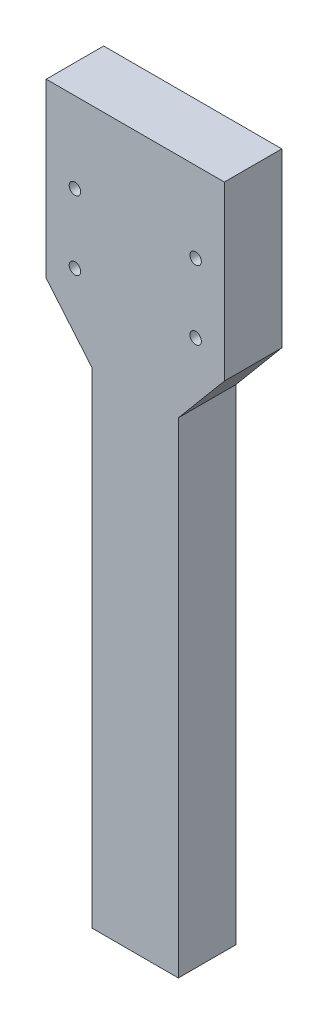
ISO-10303-21;
HEADER;
FILE_DESCRIPTION(('STEP AP214'),'2;1');
FILE_NAME('part.step','',(''),(''),'','','');
FILE_SCHEMA(('AUTOMOTIVE_DESIGN { 1 0 10303 214 1 1 1 1 }'));
ENDSEC;
DATA;
#1=APPLICATION_CONTEXT('core data for automotive mechanical design processes');
#2=APPLICATION_PROTOCOL_DEFINITION('international standard','automotive_design',2000,#1);
#3=PRODUCT_CONTEXT('',#1,'mechanical');
#4=PRODUCT('Part','Part','',(#3));
#5=PRODUCT_RELATED_PRODUCT_CATEGORY('part','',(#4));
#6=PRODUCT_DEFINITION_FORMATION('','',#4);
#7=PRODUCT_DEFINITION_CONTEXT('part definition',#1,'design');
#8=PRODUCT_DEFINITION('design','',#6,#7);
#9=PRODUCT_DEFINITION_SHAPE('','',#8);
#10=(LENGTH_UNIT() NAMED_UNIT(*) SI_UNIT(.MILLI.,.METRE.));
#11=(NAMED_UNIT(*) PLANE_ANGLE_UNIT() SI_UNIT($,.RADIAN.));
#12=(NAMED_UNIT(*) SI_UNIT($,.STERADIAN.) SOLID_ANGLE_UNIT());
#13=UNCERTAINTY_MEASURE_WITH_UNIT(LENGTH_MEASURE(1.E-05),#10,'distance_accuracy_value','');
#14=(GEOMETRIC_REPRESENTATION_CONTEXT(3) GLOBAL_UNCERTAINTY_ASSIGNED_CONTEXT((#13)) GLOBAL_UNIT_ASSIGNED_CONTEXT((#10,
#11,#12)) REPRESENTATION_CONTEXT('',''));
#15=CARTESIAN_POINT('',(0.,0.,0.));
#16=DIRECTION('',(0.,0.,1.));
#17=DIRECTION('',(1.,0.,0.));
#18=AXIS2_PLACEMENT_3D('',#15,#16,#17);
#19=CARTESIAN_POINT('',(0.,0.,10.));
#20=DIRECTION('',(0.,0.,-1.));
#21=DIRECTION('',(-1.,0.,0.));
#22=AXIS2_PLACEMENT_3D('',#19,#20,#21);
#23=PLANE('',#22);
#24=DIRECTION('',(0.,-1.,0.));
#25=VECTOR('',#24,1.);
#26=CARTESIAN_POINT('',(0.,0.,10.));
#27=LINE('',#26,#25);
#28=CARTESIAN_POINT('',(0.,84.4259712592463,10.));
#29=VERTEX_POINT('',#28);
#30=CARTESIAN_POINT('',(0.,0.,10.));
#31=VERTEX_POINT('',#30);
#32=EDGE_CURVE('E144',#29,#31,#27,.T.);
#33=ORIENTED_EDGE('',*,*,#32,.T.);
#34=DIRECTION('',(1.,0.,0.));
#35=VECTOR('',#34,1.);
#36=CARTESIAN_POINT('',(0.,0.,10.));
#37=LINE('',#36,#35);
#38=CARTESIAN_POINT('',(15.,0.,10.));
#39=VERTEX_POINT('',#38);
#40=EDGE_CURVE('E92',#31,#39,#37,.T.);
#41=ORIENTED_EDGE('',*,*,#40,.T.);
#42=DIRECTION('',(0.,1.,0.));
#43=VECTOR('',#42,1.);
#44=CARTESIAN_POINT('',(15.,0.,10.));
#45=LINE('',#44,#43);
#46=CARTESIAN_POINT('',(15.,84.4259712592463,10.));
#47=VERTEX_POINT('',#46);
#48=EDGE_CURVE('E159',#39,#47,#45,.T.);
#49=ORIENTED_EDGE('',*,*,#48,.T.);
#50=DIRECTION('',(0.64278760968654,0.766044443118978,0.));
#51=VECTOR('',#50,1.);
#52=CARTESIAN_POINT('',(15.,84.4259712592463,10.));
#53=LINE('',#52,#51);
#54=CARTESIAN_POINT('',(23.,93.96,10.));
#55=VERTEX_POINT('',#54);
#56=EDGE_CURVE('E172',#47,#55,#53,.T.);
#57=ORIENTED_EDGE('',*,*,#56,.T.);
#58=DIRECTION('',(0.,1.,0.));
#59=VECTOR('',#58,1.);
#60=CARTESIAN_POINT('',(23.,93.96,10.));
#61=LINE('',#60,#59);
#62=CARTESIAN_POINT('',(23.,123.96,10.));
#63=VERTEX_POINT('',#62);
#64=EDGE_CURVE('E111',#55,#63,#61,.T.);
#65=ORIENTED_EDGE('',*,*,#64,.T.);
#66=DIRECTION('',(-1.,0.,0.));
#67=VECTOR('',#66,1.);
#68=CARTESIAN_POINT('',(23.,123.96,10.));
#69=LINE('',#68,#67);
#70=CARTESIAN_POINT('',(-8.,123.96,10.));
#71=VERTEX_POINT('',#70);
#72=EDGE_CURVE('E105',#63,#71,#69,.T.);
#73=ORIENTED_EDGE('',*,*,#72,.T.);
#74=DIRECTION('',(0.,-1.,0.));
#75=VECTOR('',#74,1.);
#76=CARTESIAN_POINT('',(-7.99999999999999,93.96,10.));
#77=LINE('',#76,#75);
#78=CARTESIAN_POINT('',(-7.99999999999999,93.96,10.));
#79=VERTEX_POINT('',#78);
#80=EDGE_CURVE('E109',#71,#79,#77,.T.);
#81=ORIENTED_EDGE('',*,*,#80,.T.);
#82=DIRECTION('',(0.64278760968654,-0.766044443118977,0.));
#83=VECTOR('',#82,1.);
#84=CARTESIAN_POINT('',(0.,84.4259712592463,10.));
#85=LINE('',#84,#83);
#86=EDGE_CURVE('E49',#79,#29,#85,.T.);
#87=ORIENTED_EDGE('',*,*,#86,.T.);
#88=EDGE_LOOP('',(#33,#41,#49,#57,#65,#73,#81,#87));
#89=FACE_BOUND('',#88,.T.);
#90=CARTESIAN_POINT('',(-3.,109.96,10.));
#91=DIRECTION('',(0.,0.,1.));
#92=DIRECTION('',(1.,0.,0.));
#93=AXIS2_PLACEMENT_3D('',#90,#91,#92);
#94=CIRCLE('',#93,1.);
#95=CARTESIAN_POINT('',(-2.,109.96,10.));
#96=VERTEX_POINT('',#95);
#97=EDGE_CURVE('E132',#96,#96,#94,.T.);
#98=ORIENTED_EDGE('',*,*,#97,.F.);
#99=EDGE_LOOP('',(#98));
#100=FACE_BOUND('',#99,.T.);
#101=CARTESIAN_POINT('',(-3.,97.96,10.));
#102=DIRECTION('',(0.,0.,1.));
#103=DIRECTION('',(1.,0.,0.));
#104=AXIS2_PLACEMENT_3D('',#101,#102,#103);
#105=CIRCLE('',#104,1.);
#106=CARTESIAN_POINT('',(-2.,97.96,10.));
#107=VERTEX_POINT('',#106);
#108=EDGE_CURVE('E181',#107,#107,#105,.T.);
#109=ORIENTED_EDGE('',*,*,#108,.F.);
#110=EDGE_LOOP('',(#109));
#111=FACE_BOUND('',#110,.T.);
#112=CARTESIAN_POINT('',(18.,97.96,10.));
#113=DIRECTION('',(0.,0.,1.));
#114=DIRECTION('',(-1.,0.,0.));
#115=AXIS2_PLACEMENT_3D('',#112,#113,#114);
#116=CIRCLE('',#115,1.);
#117=CARTESIAN_POINT('',(17.,97.96,10.));
#118=VERTEX_POINT('',#117);
#119=EDGE_CURVE('E187',#118,#118,#116,.T.);
#120=ORIENTED_EDGE('',*,*,#119,.F.);
#121=EDGE_LOOP('',(#120));
#122=FACE_BOUND('',#121,.T.);
#123=CARTESIAN_POINT('',(18.,109.96,10.));
#124=DIRECTION('',(0.,0.,1.));
#125=DIRECTION('',(-1.,0.,0.));
#126=AXIS2_PLACEMENT_3D('',#123,#124,#125);
#127=CIRCLE('',#126,1.);
#128=CARTESIAN_POINT('',(17.,109.96,10.));
#129=VERTEX_POINT('',#128);
#130=EDGE_CURVE('E193',#129,#129,#127,.T.);
#131=ORIENTED_EDGE('',*,*,#130,.F.);
#132=EDGE_LOOP('',(#131));
#133=FACE_BOUND('',#132,.T.);
#134=ADVANCED_FACE('F32',(#89,#100,#111,#122,#133),#23,.F.);
#135=CARTESIAN_POINT('',(0.,0.,0.));
#136=DIRECTION('',(0.,0.,-1.));
#137=DIRECTION('',(-1.,0.,0.));
#138=AXIS2_PLACEMENT_3D('',#135,#136,#137);
#139=PLANE('',#138);
#140=CARTESIAN_POINT('',(18.,97.96,0.));
#141=DIRECTION('',(0.,0.,1.));
#142=DIRECTION('',(-1.,0.,0.));
#143=AXIS2_PLACEMENT_3D('',#140,#141,#142);
#144=CIRCLE('',#143,1.);
#145=CARTESIAN_POINT('',(17.,97.96,0.));
#146=VERTEX_POINT('',#145);
#147=EDGE_CURVE('E190',#146,#146,#144,.T.);
#148=ORIENTED_EDGE('',*,*,#147,.T.);
#149=EDGE_LOOP('',(#148));
#150=FACE_BOUND('',#149,.T.);
#151=CARTESIAN_POINT('',(-3.,109.96,0.));
#152=DIRECTION('',(0.,0.,1.));
#153=DIRECTION('',(1.,0.,0.));
#154=AXIS2_PLACEMENT_3D('',#151,#152,#153);
#155=CIRCLE('',#154,1.);
#156=CARTESIAN_POINT('',(-2.,109.96,0.));
#157=VERTEX_POINT('',#156);
#158=EDGE_CURVE('E178',#157,#157,#155,.T.);
#159=ORIENTED_EDGE('',*,*,#158,.T.);
#160=EDGE_LOOP('',(#159));
#161=FACE_BOUND('',#160,.T.);
#162=DIRECTION('',(0.,-1.,0.));
#163=VECTOR('',#162,1.);
#164=CARTESIAN_POINT('',(0.,0.,0.));
#165=LINE('',#164,#163);
#166=CARTESIAN_POINT('',(0.,84.4259712592463,0.));
#167=VERTEX_POINT('',#166);
#168=CARTESIAN_POINT('',(0.,0.,0.));
#169=VERTEX_POINT('',#168);
#170=EDGE_CURVE('E128',#167,#169,#165,.T.);
#171=ORIENTED_EDGE('',*,*,#170,.F.);
#172=DIRECTION('',(0.64278760968654,-0.766044443118977,0.));
#173=VECTOR('',#172,1.);
#174=CARTESIAN_POINT('',(0.,84.4259712592463,0.));
#175=LINE('',#174,#173);
#176=CARTESIAN_POINT('',(-7.99999999999999,93.96,0.));
#177=VERTEX_POINT('',#176);
#178=EDGE_CURVE('E84',#177,#167,#175,.T.);
#179=ORIENTED_EDGE('',*,*,#178,.F.);
#180=DIRECTION('',(0.,-1.,0.));
#181=VECTOR('',#180,1.);
#182=CARTESIAN_POINT('',(-7.99999999999999,93.96,0.));
#183=LINE('',#182,#181);
#184=CARTESIAN_POINT('',(-8.,123.96,0.));
#185=VERTEX_POINT('',#184);
#186=EDGE_CURVE('E78',#185,#177,#183,.T.);
#187=ORIENTED_EDGE('',*,*,#186,.F.);
#188=DIRECTION('',(-1.,0.,0.));
#189=VECTOR('',#188,1.);
#190=CARTESIAN_POINT('',(-8.,123.96,0.));
#191=LINE('',#190,#189);
#192=CARTESIAN_POINT('',(23.,123.96,0.));
#193=VERTEX_POINT('',#192);
#194=EDGE_CURVE('E118',#193,#185,#191,.T.);
#195=ORIENTED_EDGE('',*,*,#194,.F.);
#196=DIRECTION('',(0.,1.,0.));
#197=VECTOR('',#196,1.);
#198=CARTESIAN_POINT('',(23.,93.96,0.));
#199=LINE('',#198,#197);
#200=CARTESIAN_POINT('',(23.,93.96,0.));
#201=VERTEX_POINT('',#200);
#202=EDGE_CURVE('E138',#201,#193,#199,.T.);
#203=ORIENTED_EDGE('',*,*,#202,.F.);
#204=DIRECTION('',(0.64278760968654,0.766044443118978,0.));
#205=VECTOR('',#204,1.);
#206=CARTESIAN_POINT('',(15.,84.4259712592463,0.));
#207=LINE('',#206,#205);
#208=CARTESIAN_POINT('',(15.,84.4259712592463,0.));
#209=VERTEX_POINT('',#208);
#210=EDGE_CURVE('E136',#209,#201,#207,.T.);
#211=ORIENTED_EDGE('',*,*,#210,.F.);
#212=DIRECTION('',(0.,1.,0.));
#213=VECTOR('',#212,1.);
#214=CARTESIAN_POINT('',(15.,0.,0.));
#215=LINE('',#214,#213);
#216=CARTESIAN_POINT('',(15.,0.,0.));
#217=VERTEX_POINT('',#216);
#218=EDGE_CURVE('E134',#217,#209,#215,.T.);
#219=ORIENTED_EDGE('',*,*,#218,.F.);
#220=DIRECTION('',(1.,0.,0.));
#221=VECTOR('',#220,1.);
#222=CARTESIAN_POINT('',(0.,0.,0.));
#223=LINE('',#222,#221);
#224=EDGE_CURVE('E131',#169,#217,#223,.T.);
#225=ORIENTED_EDGE('',*,*,#224,.F.);
#226=EDGE_LOOP('',(#171,#179,#187,#195,#203,#211,#219,#225));
#227=FACE_BOUND('',#226,.T.);
#228=CARTESIAN_POINT('',(-3.,97.96,0.));
#229=DIRECTION('',(0.,0.,1.));
#230=DIRECTION('',(1.,0.,0.));
#231=AXIS2_PLACEMENT_3D('',#228,#229,#230);
#232=CIRCLE('',#231,1.);
#233=CARTESIAN_POINT('',(-2.,97.96,0.));
#234=VERTEX_POINT('',#233);
#235=EDGE_CURVE('E184',#234,#234,#232,.T.);
#236=ORIENTED_EDGE('',*,*,#235,.T.);
#237=EDGE_LOOP('',(#236));
#238=FACE_BOUND('',#237,.T.);
#239=CARTESIAN_POINT('',(18.,109.96,0.));
#240=DIRECTION('',(0.,0.,1.));
#241=DIRECTION('',(-1.,0.,0.));
#242=AXIS2_PLACEMENT_3D('',#239,#240,#241);
#243=CIRCLE('',#242,1.);
#244=CARTESIAN_POINT('',(17.,109.96,0.));
#245=VERTEX_POINT('',#244);
#246=EDGE_CURVE('E196',#245,#245,#243,.T.);
#247=ORIENTED_EDGE('',*,*,#246,.T.);
#248=EDGE_LOOP('',(#247));
#249=FACE_BOUND('',#248,.T.);
#250=ADVANCED_FACE('F163',(#150,#161,#227,#238,#249),#139,.T.);
#251=CARTESIAN_POINT('',(0.,0.,10.));
#252=DIRECTION('',(1.,0.,0.));
#253=DIRECTION('',(0.,0.,-1.));
#254=AXIS2_PLACEMENT_3D('',#251,#252,#253);
#255=PLANE('',#254);
#256=ORIENTED_EDGE('',*,*,#170,.T.);
#257=DIRECTION('',(0.,0.,-1.));
#258=VECTOR('',#257,1.);
#259=CARTESIAN_POINT('',(0.,0.,10.));
#260=LINE('',#259,#258);
#261=EDGE_CURVE('E11',#31,#169,#260,.T.);
#262=ORIENTED_EDGE('',*,*,#261,.F.);
#263=ORIENTED_EDGE('',*,*,#32,.F.);
#264=DIRECTION('',(0.,0.,-1.));
#265=VECTOR('',#264,1.);
#266=CARTESIAN_POINT('',(0.,84.4259712592463,10.));
#267=LINE('',#266,#265);
#268=EDGE_CURVE('E124',#29,#167,#267,.T.);
#269=ORIENTED_EDGE('',*,*,#268,.T.);
#270=EDGE_LOOP('',(#256,#262,#263,#269));
#271=FACE_BOUND('',#270,.T.);
#272=ADVANCED_FACE('F34',(#271),#255,.F.);
#273=CARTESIAN_POINT('',(0.,0.,10.));
#274=DIRECTION('',(0.,1.,0.));
#275=DIRECTION('',(0.,0.,1.));
#276=AXIS2_PLACEMENT_3D('',#273,#274,#275);
#277=PLANE('',#276);
#278=ORIENTED_EDGE('',*,*,#224,.T.);
#279=DIRECTION('',(0.,0.,-1.));
#280=VECTOR('',#279,1.);
#281=CARTESIAN_POINT('',(15.,0.,10.));
#282=LINE('',#281,#280);
#283=EDGE_CURVE('E41',#39,#217,#282,.T.);
#284=ORIENTED_EDGE('',*,*,#283,.F.);
#285=ORIENTED_EDGE('',*,*,#40,.F.);
#286=ORIENTED_EDGE('',*,*,#261,.T.);
#287=EDGE_LOOP('',(#278,#284,#285,#286));
#288=FACE_BOUND('',#287,.T.);
#289=ADVANCED_FACE('F228',(#288),#277,.F.);
#290=CARTESIAN_POINT('',(15.,0.,10.));
#291=DIRECTION('',(-1.,0.,0.));
#292=DIRECTION('',(0.,-1.,0.));
#293=AXIS2_PLACEMENT_3D('',#290,#291,#292);
#294=PLANE('',#293);
#295=ORIENTED_EDGE('',*,*,#218,.T.);
#296=DIRECTION('',(0.,0.,-1.));
#297=VECTOR('',#296,1.);
#298=CARTESIAN_POINT('',(15.,84.4259712592463,10.));
#299=LINE('',#298,#297);
#300=EDGE_CURVE('E151',#47,#209,#299,.T.);
#301=ORIENTED_EDGE('',*,*,#300,.F.);
#302=ORIENTED_EDGE('',*,*,#48,.F.);
#303=ORIENTED_EDGE('',*,*,#283,.T.);
#304=EDGE_LOOP('',(#295,#301,#302,#303));
#305=FACE_BOUND('',#304,.T.);
#306=ADVANCED_FACE('F157',(#305),#294,.F.);
#307=CARTESIAN_POINT('',(15.,84.4259712592463,10.));
#308=DIRECTION('',(-0.766044443118978,0.64278760968654,0.));
#309=DIRECTION('',(-0.64278760968654,-0.766044443118978,0.));
#310=AXIS2_PLACEMENT_3D('',#307,#308,#309);
#311=PLANE('',#310);
#312=ORIENTED_EDGE('',*,*,#210,.T.);
#313=DIRECTION('',(0.,0.,-1.));
#314=VECTOR('',#313,1.);
#315=CARTESIAN_POINT('',(23.,93.96,10.));
#316=LINE('',#315,#314);
#317=EDGE_CURVE('E148',#55,#201,#316,.T.);
#318=ORIENTED_EDGE('',*,*,#317,.F.);
#319=ORIENTED_EDGE('',*,*,#56,.F.);
#320=ORIENTED_EDGE('',*,*,#300,.T.);
#321=EDGE_LOOP('',(#312,#318,#319,#320));
#322=FACE_BOUND('',#321,.T.);
#323=ADVANCED_FACE('F168',(#322),#311,.F.);
#324=CARTESIAN_POINT('',(23.,93.96,10.));
#325=DIRECTION('',(-1.,0.,0.));
#326=DIRECTION('',(0.,0.,1.));
#327=AXIS2_PLACEMENT_3D('',#324,#325,#326);
#328=PLANE('',#327);
#329=ORIENTED_EDGE('',*,*,#202,.T.);
#330=DIRECTION('',(0.,0.,-1.));
#331=VECTOR('',#330,1.);
#332=CARTESIAN_POINT('',(23.,123.96,10.));
#333=LINE('',#332,#331);
#334=EDGE_CURVE('E119',#63,#193,#333,.T.);
#335=ORIENTED_EDGE('',*,*,#334,.F.);
#336=ORIENTED_EDGE('',*,*,#64,.F.);
#337=ORIENTED_EDGE('',*,*,#317,.T.);
#338=EDGE_LOOP('',(#329,#335,#336,#337));
#339=FACE_BOUND('',#338,.T.);
#340=ADVANCED_FACE('F171',(#339),#328,.F.);
#341=CARTESIAN_POINT('',(-8.,123.96,10.));
#342=DIRECTION('',(0.,-1.,0.));
#343=DIRECTION('',(0.,0.,-1.));
#344=AXIS2_PLACEMENT_3D('',#341,#342,#343);
#345=PLANE('',#344);
#346=ORIENTED_EDGE('',*,*,#194,.T.);
#347=DIRECTION('',(0.,0.,-1.));
#348=VECTOR('',#347,1.);
#349=CARTESIAN_POINT('',(-8.,123.96,10.));
#350=LINE('',#349,#348);
#351=EDGE_CURVE('E116',#71,#185,#350,.T.);
#352=ORIENTED_EDGE('',*,*,#351,.F.);
#353=ORIENTED_EDGE('',*,*,#72,.F.);
#354=ORIENTED_EDGE('',*,*,#334,.T.);
#355=EDGE_LOOP('',(#346,#352,#353,#354));
#356=FACE_BOUND('',#355,.T.);
#357=ADVANCED_FACE('F117',(#356),#345,.F.);
#358=CARTESIAN_POINT('',(-7.99999999999999,93.96,10.));
#359=DIRECTION('',(1.,0.,0.));
#360=DIRECTION('',(0.,1.,0.));
#361=AXIS2_PLACEMENT_3D('',#358,#359,#360);
#362=PLANE('',#361);
#363=ORIENTED_EDGE('',*,*,#186,.T.);
#364=DIRECTION('',(0.,0.,-1.));
#365=VECTOR('',#364,1.);
#366=CARTESIAN_POINT('',(-7.99999999999999,93.96,10.));
#367=LINE('',#366,#365);
#368=EDGE_CURVE('E120',#79,#177,#367,.T.);
#369=ORIENTED_EDGE('',*,*,#368,.F.);
#370=ORIENTED_EDGE('',*,*,#80,.F.);
#371=ORIENTED_EDGE('',*,*,#351,.T.);
#372=EDGE_LOOP('',(#363,#369,#370,#371));
#373=FACE_BOUND('',#372,.T.);
#374=ADVANCED_FACE('F122',(#373),#362,.F.);
#375=CARTESIAN_POINT('',(0.,84.4259712592463,10.));
#376=DIRECTION('',(0.766044443118977,0.64278760968654,0.));
#377=DIRECTION('',(-0.64278760968654,0.766044443118978,0.));
#378=AXIS2_PLACEMENT_3D('',#375,#376,#377);
#379=PLANE('',#378);
#380=ORIENTED_EDGE('',*,*,#178,.T.);
#381=ORIENTED_EDGE('',*,*,#268,.F.);
#382=ORIENTED_EDGE('',*,*,#86,.F.);
#383=ORIENTED_EDGE('',*,*,#368,.T.);
#384=EDGE_LOOP('',(#380,#381,#382,#383));
#385=FACE_BOUND('',#384,.T.);
#386=ADVANCED_FACE('F216',(#385),#379,.F.);
#387=CARTESIAN_POINT('',(-3.,109.96,10.));
#388=DIRECTION('',(0.,0.,-1.));
#389=DIRECTION('',(-1.,0.,0.));
#390=AXIS2_PLACEMENT_3D('',#387,#388,#389);
#391=CYLINDRICAL_SURFACE('',#390,1.);
#392=ORIENTED_EDGE('',*,*,#97,.T.);
#393=EDGE_LOOP('',(#392));
#394=FACE_BOUND('',#393,.T.);
#395=ORIENTED_EDGE('',*,*,#158,.F.);
#396=EDGE_LOOP('',(#395));
#397=FACE_BOUND('',#396,.T.);
#398=ADVANCED_FACE('F213',(#394,#397),#391,.F.);
#399=CARTESIAN_POINT('',(-3.,97.96,10.));
#400=DIRECTION('',(0.,0.,-1.));
#401=DIRECTION('',(-1.,0.,0.));
#402=AXIS2_PLACEMENT_3D('',#399,#400,#401);
#403=CYLINDRICAL_SURFACE('',#402,1.);
#404=ORIENTED_EDGE('',*,*,#108,.T.);
#405=EDGE_LOOP('',(#404));
#406=FACE_BOUND('',#405,.T.);
#407=ORIENTED_EDGE('',*,*,#235,.F.);
#408=EDGE_LOOP('',(#407));
#409=FACE_BOUND('',#408,.T.);
#410=ADVANCED_FACE('F298',(#406,#409),#403,.F.);
#411=CARTESIAN_POINT('',(18.,97.96,10.));
#412=DIRECTION('',(0.,0.,-1.));
#413=DIRECTION('',(-1.,0.,0.));
#414=AXIS2_PLACEMENT_3D('',#411,#412,#413);
#415=CYLINDRICAL_SURFACE('',#414,1.);
#416=ORIENTED_EDGE('',*,*,#119,.T.);
#417=EDGE_LOOP('',(#416));
#418=FACE_BOUND('',#417,.T.);
#419=ORIENTED_EDGE('',*,*,#147,.F.);
#420=EDGE_LOOP('',(#419));
#421=FACE_BOUND('',#420,.T.);
#422=ADVANCED_FACE('F306',(#418,#421),#415,.F.);
#423=CARTESIAN_POINT('',(18.,109.96,10.));
#424=DIRECTION('',(0.,0.,-1.));
#425=DIRECTION('',(-1.,0.,0.));
#426=AXIS2_PLACEMENT_3D('',#423,#424,#425);
#427=CYLINDRICAL_SURFACE('',#426,1.);
#428=ORIENTED_EDGE('',*,*,#130,.T.);
#429=EDGE_LOOP('',(#428));
#430=FACE_BOUND('',#429,.T.);
#431=ORIENTED_EDGE('',*,*,#246,.F.);
#432=EDGE_LOOP('',(#431));
#433=FACE_BOUND('',#432,.T.);
#434=ADVANCED_FACE('F202',(#430,#433),#427,.F.);
#435=CLOSED_SHELL('',(#134,#250,#272,#289,#306,#323,#340,#357,#374,#386,#398,#410,#422,#434));
#436=MANIFOLD_SOLID_BREP('B2',#435);
#437=ADVANCED_BREP_SHAPE_REPRESENTATION('',(#18,#436),#14);
#438=SHAPE_DEFINITION_REPRESENTATION(#9,#437);
ENDSEC;
END-ISO-10303-21;
